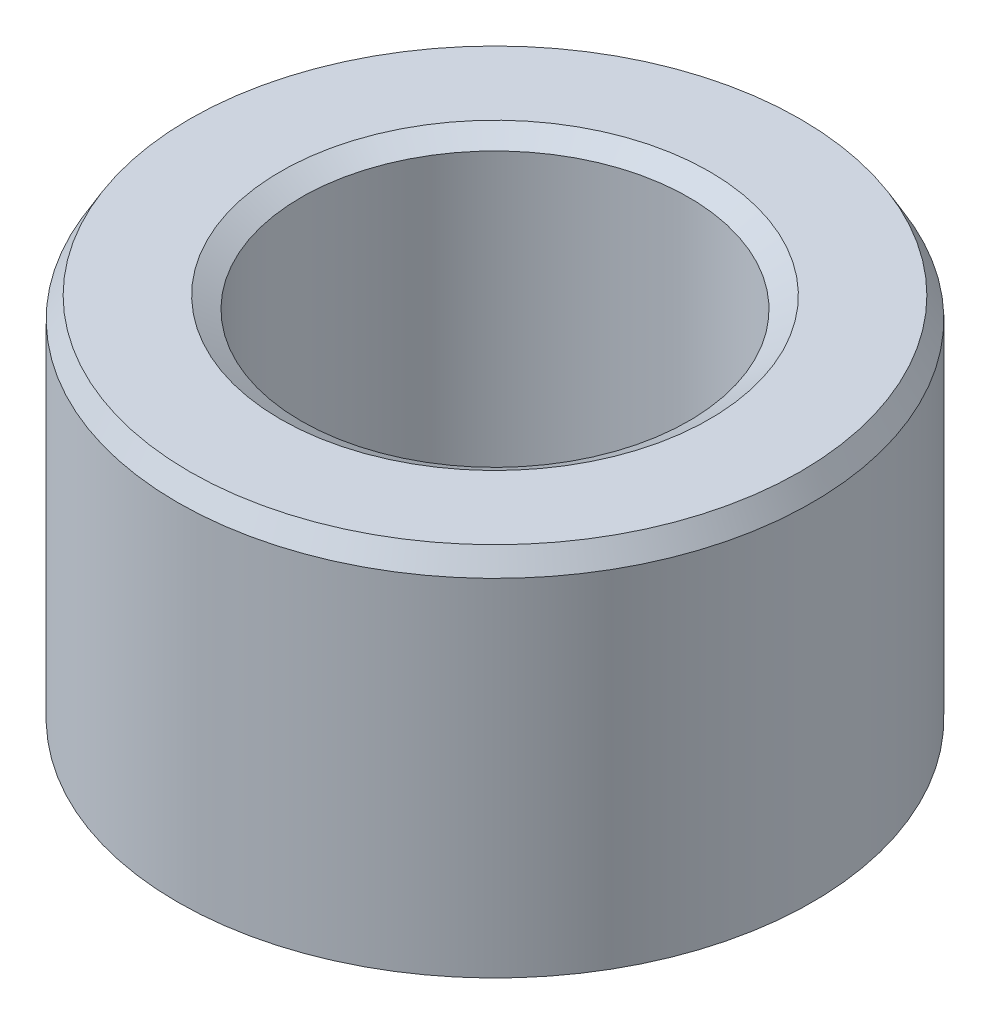
ISO-10303-21;
HEADER;
FILE_DESCRIPTION(('STEP AP214'),'2;1');
FILE_NAME('part.step','',(''),(''),'','','');
FILE_SCHEMA(('AUTOMOTIVE_DESIGN { 1 0 10303 214 1 1 1 1 }'));
ENDSEC;
DATA;
#1=APPLICATION_CONTEXT('core data for automotive mechanical design processes');
#2=APPLICATION_PROTOCOL_DEFINITION('international standard','automotive_design',2000,#1);
#3=PRODUCT_CONTEXT('',#1,'mechanical');
#4=PRODUCT('Part','Part','',(#3));
#5=PRODUCT_RELATED_PRODUCT_CATEGORY('part','',(#4));
#6=PRODUCT_DEFINITION_FORMATION('','',#4);
#7=PRODUCT_DEFINITION_CONTEXT('part definition',#1,'design');
#8=PRODUCT_DEFINITION('design','',#6,#7);
#9=PRODUCT_DEFINITION_SHAPE('','',#8);
#10=(LENGTH_UNIT() NAMED_UNIT(*) SI_UNIT(.MILLI.,.METRE.));
#11=(NAMED_UNIT(*) PLANE_ANGLE_UNIT() SI_UNIT($,.RADIAN.));
#12=(NAMED_UNIT(*) SI_UNIT($,.STERADIAN.) SOLID_ANGLE_UNIT());
#13=UNCERTAINTY_MEASURE_WITH_UNIT(LENGTH_MEASURE(1.E-05),#10,'distance_accuracy_value','');
#14=(GEOMETRIC_REPRESENTATION_CONTEXT(3) GLOBAL_UNCERTAINTY_ASSIGNED_CONTEXT((#13)) GLOBAL_UNIT_ASSIGNED_CONTEXT((#10,
#11,#12)) REPRESENTATION_CONTEXT('',''));
#15=CARTESIAN_POINT('',(0.,0.,0.));
#16=DIRECTION('',(0.,0.,1.));
#17=DIRECTION('',(1.,0.,0.));
#18=AXIS2_PLACEMENT_3D('',#15,#16,#17);
#19=CARTESIAN_POINT('',(0.,47.7405509849644,0.));
#20=DIRECTION('',(0.,-1.,0.));
#21=DIRECTION('',(0.,0.,-1.));
#22=AXIS2_PLACEMENT_3D('',#19,#20,#21);
#23=CYLINDRICAL_SURFACE('',#22,40.);
#24=CARTESIAN_POINT('',(0.,1.50859373318762,0.));
#25=DIRECTION('',(0.,1.,0.));
#26=DIRECTION('',(0.,0.,1.));
#27=AXIS2_PLACEMENT_3D('',#24,#25,#26);
#28=CIRCLE('',#27,40.);
#29=CARTESIAN_POINT('',(0.,1.50859373318762,-40.));
#30=VERTEX_POINT('',#29);
#31=EDGE_CURVE('E10',#30,#30,#28,.T.);
#32=CARTESIAN_POINT('',(0.,45.1275899911035,0.));
#33=DIRECTION('',(0.,1.,0.));
#34=DIRECTION('',(0.,0.,1.));
#35=AXIS2_PLACEMENT_3D('',#32,#33,#34);
#36=CIRCLE('',#35,40.);
#37=CARTESIAN_POINT('',(0.,45.1275899911035,-40.));
#38=VERTEX_POINT('',#37);
#39=EDGE_CURVE('E50',#38,#38,#36,.F.);
#40=CARTESIAN_POINT('',(0.,1.50859373318762,-40.));
#41=CARTESIAN_POINT('',(0.,1.96295827754091,-40.));
#42=CARTESIAN_POINT('',(0.,2.4173228218942,-40.));
#43=CARTESIAN_POINT('',(0.,3.32605191060078,-40.));
#44=CARTESIAN_POINT('',(0.,3.78041645495407,-40.));
#45=CARTESIAN_POINT('',(0.,4.68914554366065,-40.));
#46=CARTESIAN_POINT('',(0.,5.14351008801394,-40.));
#47=CARTESIAN_POINT('',(0.,6.05223917672052,-40.));
#48=CARTESIAN_POINT('',(0.,6.50660372107381,-40.));
#49=CARTESIAN_POINT('',(0.,7.41533280978039,-40.));
#50=CARTESIAN_POINT('',(0.,7.86969735413368,-40.));
#51=CARTESIAN_POINT('',(0.,8.77842644284026,-40.));
#52=CARTESIAN_POINT('',(0.,9.23279098719355,-40.));
#53=CARTESIAN_POINT('',(0.,10.1415200759001,-40.));
#54=CARTESIAN_POINT('',(0.,10.5958846202534,-40.));
#55=CARTESIAN_POINT('',(0.,11.50461370896,-40.));
#56=CARTESIAN_POINT('',(0.,11.9589782533133,-40.));
#57=CARTESIAN_POINT('',(0.,12.8677073420199,-40.));
#58=CARTESIAN_POINT('',(0.,13.3220718863732,-40.));
#59=CARTESIAN_POINT('',(0.,14.2308009750797,-40.));
#60=CARTESIAN_POINT('',(0.,14.685165519433,-40.));
#61=CARTESIAN_POINT('',(0.,15.5938946081396,-40.));
#62=CARTESIAN_POINT('',(0.,16.0482591524929,-40.));
#63=CARTESIAN_POINT('',(0.,16.9569882411995,-40.));
#64=CARTESIAN_POINT('',(0.,17.4113527855528,-40.));
#65=CARTESIAN_POINT('',(0.,18.3200818742594,-40.));
#66=CARTESIAN_POINT('',(0.,18.7744464186126,-40.));
#67=CARTESIAN_POINT('',(0.,19.6831755073192,-40.));
#68=CARTESIAN_POINT('',(0.,20.1375400516725,-40.));
#69=CARTESIAN_POINT('',(0.,21.0462691403791,-40.));
#70=CARTESIAN_POINT('',(0.,21.5006336847324,-40.));
#71=CARTESIAN_POINT('',(0.,22.409362773439,-40.));
#72=CARTESIAN_POINT('',(0.,22.8637273177923,-40.));
#73=CARTESIAN_POINT('',(0.,23.7724564064988,-40.));
#74=CARTESIAN_POINT('',(0.,24.2268209508521,-40.));
#75=CARTESIAN_POINT('',(0.,25.1355500395587,-40.));
#76=CARTESIAN_POINT('',(0.,25.589914583912,-40.));
#77=CARTESIAN_POINT('',(0.,26.4986436726186,-40.));
#78=CARTESIAN_POINT('',(0.,26.9530082169719,-40.));
#79=CARTESIAN_POINT('',(0.,27.8617373056784,-40.));
#80=CARTESIAN_POINT('',(0.,28.3161018500317,-40.));
#81=CARTESIAN_POINT('',(0.,29.2248309387383,-40.));
#82=CARTESIAN_POINT('',(0.,29.6791954830916,-40.));
#83=CARTESIAN_POINT('',(0.,30.5879245717982,-40.));
#84=CARTESIAN_POINT('',(0.,31.0422891161515,-40.));
#85=CARTESIAN_POINT('',(0.,31.9510182048581,-40.));
#86=CARTESIAN_POINT('',(0.,32.4053827492113,-40.));
#87=CARTESIAN_POINT('',(0.,33.3141118379179,-40.));
#88=CARTESIAN_POINT('',(0.,33.7684763822712,-40.));
#89=CARTESIAN_POINT('',(0.,34.6772054709778,-40.));
#90=CARTESIAN_POINT('',(0.,35.1315700153311,-40.));
#91=CARTESIAN_POINT('',(0.,36.0402991040377,-40.));
#92=CARTESIAN_POINT('',(0.,36.494663648391,-40.));
#93=CARTESIAN_POINT('',(0.,37.4033927370975,-40.));
#94=CARTESIAN_POINT('',(0.,37.8577572814508,-40.));
#95=CARTESIAN_POINT('',(0.,38.7664863701574,-40.));
#96=CARTESIAN_POINT('',(0.,39.2208509145107,-40.));
#97=CARTESIAN_POINT('',(0.,40.1295800032173,-40.));
#98=CARTESIAN_POINT('',(0.,40.5839445475706,-40.));
#99=CARTESIAN_POINT('',(0.,41.4926736362771,-40.));
#100=CARTESIAN_POINT('',(0.,41.9470381806304,-40.));
#101=CARTESIAN_POINT('',(0.,42.855767269337,-40.));
#102=CARTESIAN_POINT('',(0.,43.3101318136903,-40.));
#103=CARTESIAN_POINT('',(0.,44.2188609023969,-40.));
#104=CARTESIAN_POINT('',(0.,44.6732254467502,-40.));
#105=CARTESIAN_POINT('',(0.,45.1275899911035,-40.));
#106=B_SPLINE_CURVE_WITH_KNOTS('',3,(#40,#41,#42,#43,#44,#45,#46,#47,#48,#49,#50,#51,#52,#53,
#54,#55,#56,#57,#58,#59,#60,#61,#62,#63,#64,#65,#66,#67,#68,#69,#70,#71,#72,#73,#74,#75,#76,#77,
#78,#79,#80,#81,#82,#83,#84,#85,#86,#87,#88,#89,#90,#91,#92,#93,#94,#95,#96,#97,#98,#99,#100,
#101,#102,#103,#104,#105),.UNSPECIFIED.,.F.,.F.,(4,2,2,2,2,2,2,2,2,2,2,2,2,2,2,2,2,2,2,2,2,2,2,
2,2,2,2,2,2,2,2,2,4),(0.,1.36309363305987,2.72618726611974,4.08928089917961,5.45237453223948,
6.81546816529935,8.17856179835922,9.54165543141909,10.904749064479,12.2678426975388,
13.6309363305987,14.9940299636586,16.3571235967184,17.7202172297783,19.0833108628382,
20.4464044958981,21.8094981289579,23.1725917620178,24.5356853950777,25.8987790281375,
27.2618726611974,28.6249662942573,29.9880599273171,31.351153560377,32.7142471934369,
34.0773408264968,35.4404344595566,36.8035280926165,38.1666217256764,39.5297153587362,
40.8928089917961,42.255902624856,43.6189962579158),.UNSPECIFIED.);
#107=EDGE_CURVE('BSEAM39',#30,#38,#106,.T.);
#108=ORIENTED_EDGE('',*,*,#31,.T.);
#109=ORIENTED_EDGE('',*,*,#39,.T.);
#110=ORIENTED_EDGE('',*,*,#107,.T.);
#111=ORIENTED_EDGE('',*,*,#107,.F.);
#112=EDGE_LOOP('',(#108,#110,#109,#111));
#113=FACE_BOUND('',#112,.T.);
#114=ADVANCED_FACE('F39',(#113),#23,.T.);
#115=CARTESIAN_POINT('',(0.,47.7405509849644,0.));
#116=DIRECTION('',(0.,1.,0.));
#117=DIRECTION('',(0.,0.,1.));
#118=AXIS2_PLACEMENT_3D('',#115,#116,#117);
#119=PLANE('',#118);
#120=CARTESIAN_POINT('',(0.,47.7405509849644,0.));
#121=DIRECTION('',(0.,1.,0.));
#122=DIRECTION('',(0.,0.,1.));
#123=AXIS2_PLACEMENT_3D('',#120,#121,#122);
#124=CIRCLE('',#123,27.0377910494907);
#125=CARTESIAN_POINT('',(0.,47.7405509849644,27.0377910494907));
#126=VERTEX_POINT('',#125);
#127=EDGE_CURVE('E58',#126,#126,#124,.F.);
#128=ORIENTED_EDGE('',*,*,#127,.T.);
#129=EDGE_LOOP('',(#128));
#130=FACE_BOUND('',#129,.T.);
#131=CARTESIAN_POINT('',(0.,47.7405509849644,0.));
#132=DIRECTION('',(0.,1.,0.));
#133=DIRECTION('',(0.,0.,1.));
#134=AXIS2_PLACEMENT_3D('',#131,#132,#133);
#135=CIRCLE('',#134,38.4914062668124);
#136=CARTESIAN_POINT('',(0.,47.7405509849644,-38.4914062668124));
#137=VERTEX_POINT('',#136);
#138=EDGE_CURVE('E61',#137,#137,#135,.T.);
#139=ORIENTED_EDGE('',*,*,#138,.T.);
#140=EDGE_LOOP('',(#139));
#141=FACE_BOUND('',#140,.T.);
#142=ADVANCED_FACE('F88',(#130,#141),#119,.T.);
#143=CARTESIAN_POINT('',(0.,0.,0.));
#144=DIRECTION('',(0.,1.,0.));
#145=DIRECTION('',(0.,0.,1.));
#146=AXIS2_PLACEMENT_3D('',#143,#144,#145);
#147=PLANE('',#146);
#148=CARTESIAN_POINT('',(0.,0.,0.));
#149=DIRECTION('',(0.,1.,0.));
#150=DIRECTION('',(0.,0.,1.));
#151=AXIS2_PLACEMENT_3D('',#148,#149,#150);
#152=CIRCLE('',#151,25.9334237888173);
#153=CARTESIAN_POINT('',(0.,0.,25.9334237888173));
#154=VERTEX_POINT('',#153);
#155=EDGE_CURVE('E51',#154,#154,#152,.T.);
#156=ORIENTED_EDGE('',*,*,#155,.T.);
#157=EDGE_LOOP('',(#156));
#158=FACE_BOUND('',#157,.T.);
#159=CARTESIAN_POINT('',(0.,0.,0.));
#160=DIRECTION('',(0.,1.,0.));
#161=DIRECTION('',(0.,0.,1.));
#162=AXIS2_PLACEMENT_3D('',#159,#160,#161);
#163=CIRCLE('',#162,37.387039006139);
#164=CARTESIAN_POINT('',(0.,0.,37.387039006139));
#165=VERTEX_POINT('',#164);
#166=EDGE_CURVE('E54',#165,#165,#163,.F.);
#167=ORIENTED_EDGE('',*,*,#166,.T.);
#168=EDGE_LOOP('',(#167));
#169=FACE_BOUND('',#168,.T.);
#170=ADVANCED_FACE('F83',(#158,#169),#147,.F.);
#171=CARTESIAN_POINT('',(0.,47.7405509849644,0.));
#172=DIRECTION('',(0.,-1.,0.));
#173=DIRECTION('',(0.,0.,-1.));
#174=AXIS2_PLACEMENT_3D('',#171,#172,#173);
#175=CYLINDRICAL_SURFACE('',#174,24.4248300556297);
#176=CARTESIAN_POINT('',(0.,46.2319572517768,0.));
#177=DIRECTION('',(0.,1.,0.));
#178=DIRECTION('',(0.,0.,1.));
#179=AXIS2_PLACEMENT_3D('',#176,#177,#178);
#180=CIRCLE('',#179,24.4248300556297);
#181=CARTESIAN_POINT('',(0.,46.2319572517768,24.4248300556297));
#182=VERTEX_POINT('',#181);
#183=EDGE_CURVE('E67',#182,#182,#180,.T.);
#184=ORIENTED_EDGE('',*,*,#183,.T.);
#185=EDGE_LOOP('',(#184));
#186=FACE_BOUND('',#185,.T.);
#187=CARTESIAN_POINT('',(0.,2.61296099386099,0.));
#188=DIRECTION('',(0.,1.,0.));
#189=DIRECTION('',(0.,0.,1.));
#190=AXIS2_PLACEMENT_3D('',#187,#188,#189);
#191=CIRCLE('',#190,24.4248300556297);
#192=CARTESIAN_POINT('',(0.,2.61296099386099,24.4248300556297));
#193=VERTEX_POINT('',#192);
#194=EDGE_CURVE('E69',#193,#193,#191,.F.);
#195=ORIENTED_EDGE('',*,*,#194,.T.);
#196=EDGE_LOOP('',(#195));
#197=FACE_BOUND('',#196,.T.);
#198=ADVANCED_FACE('F71',(#186,#197),#175,.F.);
#199=CARTESIAN_POINT('',(0.,46.2319572517768,0.));
#200=DIRECTION('',(0.,1.,0.));
#201=DIRECTION('',(0.,0.,1.));
#202=AXIS2_PLACEMENT_3D('',#199,#200,#201);
#203=CONICAL_SURFACE('',#202,24.4248300556297,1.0471975511966);
#204=ORIENTED_EDGE('',*,*,#127,.F.);
#205=EDGE_LOOP('',(#204));
#206=FACE_BOUND('',#205,.T.);
#207=ORIENTED_EDGE('',*,*,#183,.F.);
#208=EDGE_LOOP('',(#207));
#209=FACE_BOUND('',#208,.T.);
#210=ADVANCED_FACE('F77',(#206,#209),#203,.F.);
#211=CARTESIAN_POINT('',(0.,0.,0.));
#212=DIRECTION('',(0.,-1.,0.));
#213=DIRECTION('',(0.,0.,-1.));
#214=AXIS2_PLACEMENT_3D('',#211,#212,#213);
#215=CONICAL_SURFACE('',#214,25.9334237888173,0.523598775598295);
#216=ORIENTED_EDGE('',*,*,#194,.F.);
#217=EDGE_LOOP('',(#216));
#218=FACE_BOUND('',#217,.T.);
#219=ORIENTED_EDGE('',*,*,#155,.F.);
#220=EDGE_LOOP('',(#219));
#221=FACE_BOUND('',#220,.T.);
#222=ADVANCED_FACE('F73',(#218,#221),#215,.F.);
#223=CARTESIAN_POINT('',(0.,1.50859373318762,0.));
#224=DIRECTION('',(0.,1.,0.));
#225=DIRECTION('',(0.,0.,1.));
#226=AXIS2_PLACEMENT_3D('',#223,#224,#225);
#227=CONICAL_SURFACE('',#226,40.,1.0471975511966);
#228=ORIENTED_EDGE('',*,*,#166,.F.);
#229=EDGE_LOOP('',(#228));
#230=FACE_BOUND('',#229,.T.);
#231=ORIENTED_EDGE('',*,*,#31,.F.);
#232=EDGE_LOOP('',(#231));
#233=FACE_BOUND('',#232,.T.);
#234=ADVANCED_FACE('F76',(#230,#233),#227,.T.);
#235=CARTESIAN_POINT('',(0.,47.7405509849644,0.));
#236=DIRECTION('',(0.,-1.,0.));
#237=DIRECTION('',(0.,0.,-1.));
#238=AXIS2_PLACEMENT_3D('',#235,#236,#237);
#239=CONICAL_SURFACE('',#238,38.4914062668124,0.523598775598297);
#240=CARTESIAN_POINT('',(0.,45.1275899911035,-40.));
#241=CARTESIAN_POINT('',(0.,45.1548083347895,-39.984285481946));
#242=CARTESIAN_POINT('',(0.,45.1820266784756,-39.9685709638919));
#243=CARTESIAN_POINT('',(0.,45.2364633658477,-39.9371419277839));
#244=CARTESIAN_POINT('',(0.,45.2636817095337,-39.9214274097298));
#245=CARTESIAN_POINT('',(0.,45.3181183969058,-39.8899983736217));
#246=CARTESIAN_POINT('',(0.,45.3453367405919,-39.8742838555677));
#247=CARTESIAN_POINT('',(0.,45.399773427964,-39.8428548194596));
#248=CARTESIAN_POINT('',(0.,45.42699177165,-39.8271403014056));
#249=CARTESIAN_POINT('',(0.,45.4814284590221,-39.7957112652975));
#250=CARTESIAN_POINT('',(0.,45.5086468027082,-39.7799967472435));
#251=CARTESIAN_POINT('',(0.,45.5630834900803,-39.7485677111354));
#252=CARTESIAN_POINT('',(0.,45.5903018337663,-39.7328531930814));
#253=CARTESIAN_POINT('',(0.,45.6447385211385,-39.7014241569733));
#254=CARTESIAN_POINT('',(0.,45.6719568648245,-39.6857096389192));
#255=CARTESIAN_POINT('',(0.,45.7263935521966,-39.6542806028112));
#256=CARTESIAN_POINT('',(0.,45.7536118958827,-39.6385660847571));
#257=CARTESIAN_POINT('',(0.,45.8080485832548,-39.6071370486491));
#258=CARTESIAN_POINT('',(0.,45.8352669269408,-39.591422530595));
#259=CARTESIAN_POINT('',(0.,45.8897036143129,-39.5599934944869));
#260=CARTESIAN_POINT('',(0.,45.916921957999,-39.5442789764329));
#261=CARTESIAN_POINT('',(0.,45.9713586453711,-39.5128499403248));
#262=CARTESIAN_POINT('',(0.,45.9985769890571,-39.4971354222708));
#263=CARTESIAN_POINT('',(0.,46.0530136764292,-39.4657063861627));
#264=CARTESIAN_POINT('',(0.,46.0802320201153,-39.4499918681087));
#265=CARTESIAN_POINT('',(0.,46.1346687074874,-39.4185628320006));
#266=CARTESIAN_POINT('',(0.,46.1618870511734,-39.4028483139466));
#267=CARTESIAN_POINT('',(0.,46.2163237385455,-39.3714192778385));
#268=CARTESIAN_POINT('',(0.,46.2435420822316,-39.3557047597845));
#269=CARTESIAN_POINT('',(0.,46.2979787696037,-39.3242757236764));
#270=CARTESIAN_POINT('',(0.,46.3251971132897,-39.3085612056223));
#271=CARTESIAN_POINT('',(0.,46.3796338006618,-39.2771321695143));
#272=CARTESIAN_POINT('',(0.,46.4068521443479,-39.2614176514602));
#273=CARTESIAN_POINT('',(0.,46.46128883172,-39.2299886153522));
#274=CARTESIAN_POINT('',(0.,46.4885071754061,-39.2142740972981));
#275=CARTESIAN_POINT('',(0.,46.5429438627782,-39.18284506119));
#276=CARTESIAN_POINT('',(0.,46.5701622064642,-39.167130543136));
#277=CARTESIAN_POINT('',(0.,46.6245988938363,-39.1357015070279));
#278=CARTESIAN_POINT('',(0.,46.6518172375224,-39.1199869889739));
#279=CARTESIAN_POINT('',(0.,46.7062539248945,-39.0885579528658));
#280=CARTESIAN_POINT('',(0.,46.7334722685805,-39.0728434348118));
#281=CARTESIAN_POINT('',(0.,46.7879089559526,-39.0414143987037));
#282=CARTESIAN_POINT('',(0.,46.8151272996387,-39.0256998806497));
#283=CARTESIAN_POINT('',(0.,46.8695639870108,-38.9942708445416));
#284=CARTESIAN_POINT('',(0.,46.8967823306968,-38.9785563264875));
#285=CARTESIAN_POINT('',(0.,46.9512190180689,-38.9471272903795));
#286=CARTESIAN_POINT('',(0.,46.978437361755,-38.9314127723254));
#287=CARTESIAN_POINT('',(0.,47.0328740491271,-38.8999837362174));
#288=CARTESIAN_POINT('',(0.,47.0600923928131,-38.8842692181633));
#289=CARTESIAN_POINT('',(0.,47.1145290801852,-38.8528401820553));
#290=CARTESIAN_POINT('',(0.,47.1417474238713,-38.8371256640012));
#291=CARTESIAN_POINT('',(0.,47.1961841112434,-38.8056966278931));
#292=CARTESIAN_POINT('',(0.,47.2234024549295,-38.7899821098391));
#293=CARTESIAN_POINT('',(0.,47.2778391423016,-38.758553073731));
#294=CARTESIAN_POINT('',(0.,47.3050574859876,-38.742838555677));
#295=CARTESIAN_POINT('',(0.,47.3594941733597,-38.7114095195689));
#296=CARTESIAN_POINT('',(0.,47.3867125170458,-38.6956950015149));
#297=CARTESIAN_POINT('',(0.,47.4411492044179,-38.6642659654068));
#298=CARTESIAN_POINT('',(0.,47.4683675481039,-38.6485514473528));
#299=CARTESIAN_POINT('',(0.,47.522804235476,-38.6171224112447));
#300=CARTESIAN_POINT('',(0.,47.5500225791621,-38.6014078931907));
#301=CARTESIAN_POINT('',(0.,47.6044592665342,-38.5699788570826));
#302=CARTESIAN_POINT('',(0.,47.6316776102202,-38.5542643390285));
#303=CARTESIAN_POINT('',(0.,47.6861142975923,-38.5228353029205));
#304=CARTESIAN_POINT('',(0.,47.7133326412784,-38.5071207848664));
#305=CARTESIAN_POINT('',(0.,47.7405509849644,-38.4914062668124));
#306=B_SPLINE_CURVE_WITH_KNOTS('',3,(#240,#241,#242,#243,#244,#245,#246,#247,#248,#249,#250,
#251,#252,#253,#254,#255,#256,#257,#258,#259,#260,#261,#262,#263,#264,#265,#266,#267,#268,#269,
#270,#271,#272,#273,#274,#275,#276,#277,#278,#279,#280,#281,#282,#283,#284,#285,#286,#287,#288,
#289,#290,#291,#292,#293,#294,#295,#296,#297,#298,#299,#300,#301,#302,#303,#304,#305),
.UNSPECIFIED.,.F.,.F.,(4,2,2,2,2,2,2,2,2,2,2,2,2,2,2,2,2,2,2,2,2,2,2,2,2,2,2,2,2,2,2,2,4),(0.,
0.0942871083242262,0.188574216648452,0.282861324972678,0.377148433296908,0.471435541621134,
0.56572264994536,0.660009758269587,0.754296866593813,0.848583974918042,0.942871083242263,
1.03715819156649,1.13144529989071,1.22573240821494,1.32001951653917,1.4143066248634,
1.50859373318762,1.60288084151185,1.69716794983608,1.7914550581603,1.88574216648453,
1.98002927480876,2.07431638313298,2.16860349145721,2.26289059978143,2.35717770810566,
2.45146481642988,2.54575192475411,2.64003903307834,2.73432614140257,2.82861324972679,
2.92290035805102,3.01718746637525),.UNSPECIFIED.);
#307=EDGE_CURVE('BSEAM45',#38,#137,#306,.T.);
#308=ORIENTED_EDGE('',*,*,#39,.F.);
#309=ORIENTED_EDGE('',*,*,#138,.F.);
#310=ORIENTED_EDGE('',*,*,#307,.T.);
#311=ORIENTED_EDGE('',*,*,#307,.F.);
#312=EDGE_LOOP('',(#308,#310,#309,#311));
#313=FACE_BOUND('',#312,.T.);
#314=ADVANCED_FACE('F45',(#313),#239,.T.);
#315=CLOSED_SHELL('',(#114,#142,#170,#198,#210,#222,#234,#314));
#316=MANIFOLD_SOLID_BREP('B2',#315);
#317=ADVANCED_BREP_SHAPE_REPRESENTATION('',(#18,#316),#14);
#318=SHAPE_DEFINITION_REPRESENTATION(#9,#317);
ENDSEC;
END-ISO-10303-21;
